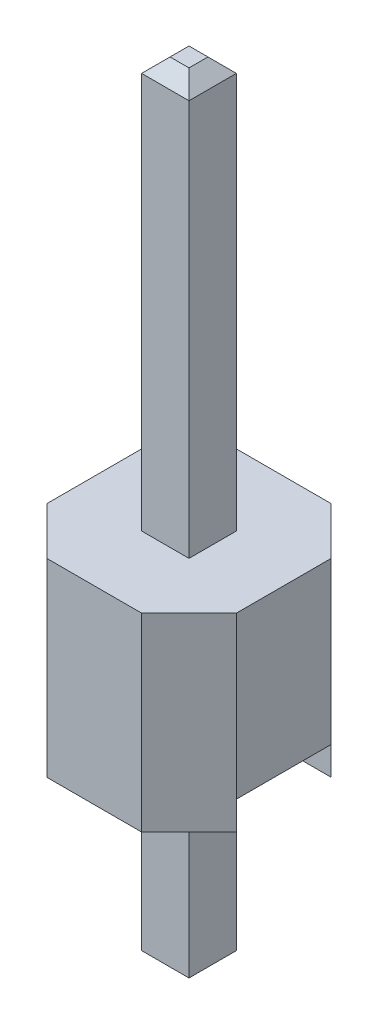
ISO-10303-21;
HEADER;
FILE_DESCRIPTION(('STEP AP214'),'2;1');
FILE_NAME('part.step','',(''),(''),'','','');
FILE_SCHEMA(('AUTOMOTIVE_DESIGN { 1 0 10303 214 1 1 1 1 }'));
ENDSEC;
DATA;
#1=APPLICATION_CONTEXT('core data for automotive mechanical design processes');
#2=APPLICATION_PROTOCOL_DEFINITION('international standard','automotive_design',2000,#1);
#3=PRODUCT_CONTEXT('',#1,'mechanical');
#4=PRODUCT('Part','Part','',(#3));
#5=PRODUCT_RELATED_PRODUCT_CATEGORY('part','',(#4));
#6=PRODUCT_DEFINITION_FORMATION('','',#4);
#7=PRODUCT_DEFINITION_CONTEXT('part definition',#1,'design');
#8=PRODUCT_DEFINITION('design','',#6,#7);
#9=PRODUCT_DEFINITION_SHAPE('','',#8);
#10=(LENGTH_UNIT() NAMED_UNIT(*) SI_UNIT(.MILLI.,.METRE.));
#11=(NAMED_UNIT(*) PLANE_ANGLE_UNIT() SI_UNIT($,.RADIAN.));
#12=(NAMED_UNIT(*) SI_UNIT($,.STERADIAN.) SOLID_ANGLE_UNIT());
#13=UNCERTAINTY_MEASURE_WITH_UNIT(LENGTH_MEASURE(1.E-05),#10,'distance_accuracy_value','');
#14=(GEOMETRIC_REPRESENTATION_CONTEXT(3) GLOBAL_UNCERTAINTY_ASSIGNED_CONTEXT((#13)) GLOBAL_UNIT_ASSIGNED_CONTEXT((#10,
#11,#12)) REPRESENTATION_CONTEXT('',''));
#15=CARTESIAN_POINT('',(0.,0.,0.));
#16=DIRECTION('',(0.,0.,1.));
#17=DIRECTION('',(1.,0.,0.));
#18=AXIS2_PLACEMENT_3D('',#15,#16,#17);
#19=CARTESIAN_POINT('',(-2.59591892663164,0.381,0.634999999999996));
#20=DIRECTION('',(0.,1.,0.));
#21=DIRECTION('',(0.,0.,1.));
#22=AXIS2_PLACEMENT_3D('',#19,#20,#21);
#23=PLANE('',#22);
#24=DIRECTION('',(0.,0.,-1.));
#25=VECTOR('',#24,1.);
#26=CARTESIAN_POINT('',(-1.27,0.381,0.635000000000008));
#27=LINE('',#26,#25);
#28=CARTESIAN_POINT('',(-1.27,0.381,0.634999999999998));
#29=VERTEX_POINT('',#28);
#30=CARTESIAN_POINT('',(-1.26999999999999,0.381,-0.635000000000004));
#31=VERTEX_POINT('',#30);
#32=EDGE_CURVE('E241',#29,#31,#27,.T.);
#33=ORIENTED_EDGE('',*,*,#32,.T.);
#34=DIRECTION('',(1.,0.,0.));
#35=VECTOR('',#34,1.);
#36=CARTESIAN_POINT('',(-2.59591892663164,0.381,-0.635000000000004));
#37=LINE('',#36,#35);
#38=CARTESIAN_POINT('',(1.27,0.381,-0.634999999999998));
#39=VERTEX_POINT('',#38);
#40=EDGE_CURVE('E249',#31,#39,#37,.T.);
#41=ORIENTED_EDGE('',*,*,#40,.T.);
#42=DIRECTION('',(0.,0.,1.));
#43=VECTOR('',#42,1.);
#44=CARTESIAN_POINT('',(1.27,0.381,0.635000000000002));
#45=LINE('',#44,#43);
#46=CARTESIAN_POINT('',(1.27,0.381,0.635000000000002));
#47=VERTEX_POINT('',#46);
#48=EDGE_CURVE('E244',#39,#47,#45,.T.);
#49=ORIENTED_EDGE('',*,*,#48,.T.);
#50=DIRECTION('',(1.,0.,0.));
#51=VECTOR('',#50,1.);
#52=CARTESIAN_POINT('',(-2.59591892663164,0.381,0.634999999999996));
#53=LINE('',#52,#51);
#54=EDGE_CURVE('E254',#29,#47,#53,.T.);
#55=ORIENTED_EDGE('',*,*,#54,.F.);
#56=EDGE_LOOP('',(#33,#41,#49,#55));
#57=FACE_BOUND('',#56,.T.);
#58=DIRECTION('',(0.,0.,1.));
#59=VECTOR('',#58,1.);
#60=CARTESIAN_POINT('',(0.3175,0.381,-0.3175));
#61=LINE('',#60,#59);
#62=CARTESIAN_POINT('',(0.3175,0.381,-0.3175));
#63=VERTEX_POINT('',#62);
#64=CARTESIAN_POINT('',(0.3175,0.381,0.3175));
#65=VERTEX_POINT('',#64);
#66=EDGE_CURVE('E186',#63,#65,#61,.T.);
#67=ORIENTED_EDGE('',*,*,#66,.F.);
#68=DIRECTION('',(1.,0.,0.));
#69=VECTOR('',#68,1.);
#70=CARTESIAN_POINT('',(-0.3175,0.381,-0.3175));
#71=LINE('',#70,#69);
#72=CARTESIAN_POINT('',(-0.3175,0.381,-0.3175));
#73=VERTEX_POINT('',#72);
#74=EDGE_CURVE('E191',#73,#63,#71,.T.);
#75=ORIENTED_EDGE('',*,*,#74,.F.);
#76=DIRECTION('',(0.,0.,-1.));
#77=VECTOR('',#76,1.);
#78=CARTESIAN_POINT('',(-0.3175,0.381,-0.3175));
#79=LINE('',#78,#77);
#80=CARTESIAN_POINT('',(-0.3175,0.381,0.3175));
#81=VERTEX_POINT('',#80);
#82=EDGE_CURVE('E203',#81,#73,#79,.T.);
#83=ORIENTED_EDGE('',*,*,#82,.F.);
#84=DIRECTION('',(-1.,0.,0.));
#85=VECTOR('',#84,1.);
#86=CARTESIAN_POINT('',(-0.3175,0.381,0.3175));
#87=LINE('',#86,#85);
#88=EDGE_CURVE('E199',#65,#81,#87,.T.);
#89=ORIENTED_EDGE('',*,*,#88,.F.);
#90=EDGE_LOOP('',(#67,#75,#83,#89));
#91=FACE_BOUND('',#90,.T.);
#92=ADVANCED_FACE('F36',(#57,#91),#23,.F.);
#93=CARTESIAN_POINT('',(0.,2.54,0.));
#94=DIRECTION('',(0.,1.,0.));
#95=DIRECTION('',(0.,0.,1.));
#96=AXIS2_PLACEMENT_3D('',#93,#94,#95);
#97=PLANE('',#96);
#98=DIRECTION('',(-1.,0.,0.));
#99=VECTOR('',#98,1.);
#100=CARTESIAN_POINT('',(-0.634999999999986,2.54,-1.27000000000001));
#101=LINE('',#100,#99);
#102=CARTESIAN_POINT('',(0.634999999999999,2.54,-1.27));
#103=VERTEX_POINT('',#102);
#104=CARTESIAN_POINT('',(-0.634999999999986,2.54,-1.27000000000001));
#105=VERTEX_POINT('',#104);
#106=EDGE_CURVE('E259',#103,#105,#101,.T.);
#107=ORIENTED_EDGE('',*,*,#106,.T.);
#108=DIRECTION('',(-0.707106781186555,0.,0.70710678118654));
#109=VECTOR('',#108,1.);
#110=CARTESIAN_POINT('',(-1.26999999999999,2.54,-0.635000000000013));
#111=LINE('',#110,#109);
#112=CARTESIAN_POINT('',(-1.26999999999999,2.54,-0.635000000000013));
#113=VERTEX_POINT('',#112);
#114=EDGE_CURVE('E262',#105,#113,#111,.T.);
#115=ORIENTED_EDGE('',*,*,#114,.T.);
#116=DIRECTION('',(0.,0.,1.));
#117=VECTOR('',#116,1.);
#118=CARTESIAN_POINT('',(-1.27,2.54,0.63499999999999));
#119=LINE('',#118,#117);
#120=CARTESIAN_POINT('',(-1.27,2.54,0.63499999999999));
#121=VERTEX_POINT('',#120);
#122=EDGE_CURVE('E265',#113,#121,#119,.T.);
#123=ORIENTED_EDGE('',*,*,#122,.T.);
#124=DIRECTION('',(0.707106781186542,0.,0.707106781186553));
#125=VECTOR('',#124,1.);
#126=CARTESIAN_POINT('',(-0.635000000000008,2.54,1.27));
#127=LINE('',#126,#125);
#128=CARTESIAN_POINT('',(-0.635000000000008,2.54,1.27));
#129=VERTEX_POINT('',#128);
#130=EDGE_CURVE('E267',#121,#129,#127,.T.);
#131=ORIENTED_EDGE('',*,*,#130,.T.);
#132=DIRECTION('',(1.,0.,0.));
#133=VECTOR('',#132,1.);
#134=CARTESIAN_POINT('',(-0.635000000000008,2.54,1.27));
#135=LINE('',#134,#133);
#136=CARTESIAN_POINT('',(0.634999999999995,2.54,1.27));
#137=VERTEX_POINT('',#136);
#138=EDGE_CURVE('E269',#129,#137,#135,.T.);
#139=ORIENTED_EDGE('',*,*,#138,.T.);
#140=DIRECTION('',(0.70710678118655,0.,-0.707106781186545));
#141=VECTOR('',#140,1.);
#142=CARTESIAN_POINT('',(1.27,2.54,0.635000000000004));
#143=LINE('',#142,#141);
#144=CARTESIAN_POINT('',(1.27,2.54,0.635000000000004));
#145=VERTEX_POINT('',#144);
#146=EDGE_CURVE('E271',#137,#145,#143,.T.);
#147=ORIENTED_EDGE('',*,*,#146,.T.);
#148=DIRECTION('',(0.,0.,-1.));
#149=VECTOR('',#148,1.);
#150=CARTESIAN_POINT('',(1.27,2.54,0.635000000000004));
#151=LINE('',#150,#149);
#152=CARTESIAN_POINT('',(1.27,2.54,-0.634999999999999));
#153=VERTEX_POINT('',#152);
#154=EDGE_CURVE('E273',#145,#153,#151,.T.);
#155=ORIENTED_EDGE('',*,*,#154,.T.);
#156=DIRECTION('',(-0.707106781186548,0.,-0.707106781186548));
#157=VECTOR('',#156,1.);
#158=CARTESIAN_POINT('',(0.634999999999999,2.54,-1.27));
#159=LINE('',#158,#157);
#160=EDGE_CURVE('E275',#153,#103,#159,.T.);
#161=ORIENTED_EDGE('',*,*,#160,.T.);
#162=EDGE_LOOP('',(#107,#115,#123,#131,#139,#147,#155,#161));
#163=FACE_BOUND('',#162,.T.);
#164=DIRECTION('',(-1.,0.,0.));
#165=VECTOR('',#164,1.);
#166=CARTESIAN_POINT('',(-0.3175,2.54,-0.3175));
#167=LINE('',#166,#165);
#168=CARTESIAN_POINT('',(0.3175,2.54,-0.3175));
#169=VERTEX_POINT('',#168);
#170=CARTESIAN_POINT('',(-0.3175,2.54,-0.3175));
#171=VERTEX_POINT('',#170);
#172=EDGE_CURVE('E217',#169,#171,#167,.T.);
#173=ORIENTED_EDGE('',*,*,#172,.F.);
#174=DIRECTION('',(0.,0.,-1.));
#175=VECTOR('',#174,1.);
#176=CARTESIAN_POINT('',(0.3175,2.54,0.3175));
#177=LINE('',#176,#175);
#178=CARTESIAN_POINT('',(0.3175,2.54,0.3175));
#179=VERTEX_POINT('',#178);
#180=EDGE_CURVE('E214',#179,#169,#177,.T.);
#181=ORIENTED_EDGE('',*,*,#180,.F.);
#182=DIRECTION('',(1.,0.,0.));
#183=VECTOR('',#182,1.);
#184=CARTESIAN_POINT('',(-0.3175,2.54,0.3175));
#185=LINE('',#184,#183);
#186=CARTESIAN_POINT('',(-0.3175,2.54,0.3175));
#187=VERTEX_POINT('',#186);
#188=EDGE_CURVE('E224',#187,#179,#185,.T.);
#189=ORIENTED_EDGE('',*,*,#188,.F.);
#190=DIRECTION('',(0.,0.,1.));
#191=VECTOR('',#190,1.);
#192=CARTESIAN_POINT('',(-0.3175,2.54,0.3175));
#193=LINE('',#192,#191);
#194=EDGE_CURVE('E221',#171,#187,#193,.T.);
#195=ORIENTED_EDGE('',*,*,#194,.F.);
#196=EDGE_LOOP('',(#173,#181,#189,#195));
#197=FACE_BOUND('',#196,.T.);
#198=ADVANCED_FACE('F389',(#163,#197),#97,.T.);
#199=CARTESIAN_POINT('',(0.,0.,0.));
#200=DIRECTION('',(0.,1.,0.));
#201=DIRECTION('',(0.,0.,1.));
#202=AXIS2_PLACEMENT_3D('',#199,#200,#201);
#203=PLANE('',#202);
#204=DIRECTION('',(-0.707106781186548,0.,-0.707106781186548));
#205=VECTOR('',#204,1.);
#206=CARTESIAN_POINT('',(0.634999999999999,0.,-1.27));
#207=LINE('',#206,#205);
#208=CARTESIAN_POINT('',(1.27,0.,-0.634999999999999));
#209=VERTEX_POINT('',#208);
#210=CARTESIAN_POINT('',(0.634999999999999,0.,-1.27));
#211=VERTEX_POINT('',#210);
#212=EDGE_CURVE('E263',#209,#211,#207,.T.);
#213=ORIENTED_EDGE('',*,*,#212,.F.);
#214=DIRECTION('',(1.,0.,0.));
#215=VECTOR('',#214,1.);
#216=CARTESIAN_POINT('',(-2.59591892663164,0.,-0.635000000000005));
#217=LINE('',#216,#215);
#218=CARTESIAN_POINT('',(-1.26999999999999,0.,-0.635000000000006));
#219=VERTEX_POINT('',#218);
#220=EDGE_CURVE('E239',#219,#209,#217,.T.);
#221=ORIENTED_EDGE('',*,*,#220,.F.);
#222=DIRECTION('',(-0.707106781186555,0.,0.70710678118654));
#223=VECTOR('',#222,1.);
#224=CARTESIAN_POINT('',(-1.26999999999999,0.,-0.635000000000013));
#225=LINE('',#224,#223);
#226=CARTESIAN_POINT('',(-0.634999999999986,0.,-1.27000000000001));
#227=VERTEX_POINT('',#226);
#228=EDGE_CURVE('E280',#227,#219,#225,.T.);
#229=ORIENTED_EDGE('',*,*,#228,.F.);
#230=DIRECTION('',(-1.,0.,0.));
#231=VECTOR('',#230,1.);
#232=CARTESIAN_POINT('',(-0.634999999999986,0.,-1.27000000000001));
#233=LINE('',#232,#231);
#234=EDGE_CURVE('E258',#211,#227,#233,.T.);
#235=ORIENTED_EDGE('',*,*,#234,.F.);
#236=EDGE_LOOP('',(#213,#221,#229,#235));
#237=FACE_BOUND('',#236,.T.);
#238=ADVANCED_FACE('F395',(#237),#203,.F.);
#239=CARTESIAN_POINT('',(-0.634999999999986,2.54,-1.27000000000001));
#240=DIRECTION('',(0.,0.,1.));
#241=DIRECTION('',(1.,0.,0.));
#242=AXIS2_PLACEMENT_3D('',#239,#240,#241);
#243=PLANE('',#242);
#244=ORIENTED_EDGE('',*,*,#234,.T.);
#245=DIRECTION('',(0.,-1.,0.));
#246=VECTOR('',#245,1.);
#247=CARTESIAN_POINT('',(-0.634999999999986,2.54,-1.27000000000001));
#248=LINE('',#247,#246);
#249=EDGE_CURVE('E311',#105,#227,#248,.T.);
#250=ORIENTED_EDGE('',*,*,#249,.F.);
#251=ORIENTED_EDGE('',*,*,#106,.F.);
#252=DIRECTION('',(0.,-1.,0.));
#253=VECTOR('',#252,1.);
#254=CARTESIAN_POINT('',(0.634999999999999,2.54,-1.27));
#255=LINE('',#254,#253);
#256=EDGE_CURVE('E277',#103,#211,#255,.T.);
#257=ORIENTED_EDGE('',*,*,#256,.T.);
#258=EDGE_LOOP('',(#244,#250,#251,#257));
#259=FACE_BOUND('',#258,.T.);
#260=ADVANCED_FACE('F437',(#259),#243,.F.);
#261=CARTESIAN_POINT('',(-1.26999999999999,2.54,-0.635000000000013));
#262=DIRECTION('',(0.70710678118654,0.,0.707106781186555));
#263=DIRECTION('',(0.707106781186555,0.,-0.70710678118654));
#264=AXIS2_PLACEMENT_3D('',#261,#262,#263);
#265=PLANE('',#264);
#266=ORIENTED_EDGE('',*,*,#228,.T.);
#267=DIRECTION('',(0.,-1.,0.));
#268=VECTOR('',#267,1.);
#269=CARTESIAN_POINT('',(-1.26999999999999,0.,-0.635000000000003));
#270=LINE('',#269,#268);
#271=EDGE_CURVE('E238',#31,#219,#270,.T.);
#272=ORIENTED_EDGE('',*,*,#271,.F.);
#273=DIRECTION('',(0.,-1.,0.));
#274=VECTOR('',#273,1.);
#275=CARTESIAN_POINT('',(-1.26999999999999,2.54,-0.635000000000013));
#276=LINE('',#275,#274);
#277=EDGE_CURVE('E308',#113,#31,#276,.T.);
#278=ORIENTED_EDGE('',*,*,#277,.F.);
#279=ORIENTED_EDGE('',*,*,#114,.F.);
#280=ORIENTED_EDGE('',*,*,#249,.T.);
#281=EDGE_LOOP('',(#266,#272,#278,#279,#280));
#282=FACE_BOUND('',#281,.T.);
#283=ADVANCED_FACE('F433',(#282),#265,.F.);
#284=CARTESIAN_POINT('',(-1.27,2.54,0.63499999999999));
#285=DIRECTION('',(1.,0.,0.));
#286=DIRECTION('',(0.,0.,-1.));
#287=AXIS2_PLACEMENT_3D('',#284,#285,#286);
#288=PLANE('',#287);
#289=ORIENTED_EDGE('',*,*,#277,.T.);
#290=ORIENTED_EDGE('',*,*,#32,.F.);
#291=DIRECTION('',(0.,-1.,0.));
#292=VECTOR('',#291,1.);
#293=CARTESIAN_POINT('',(-1.27,2.54,0.63499999999999));
#294=LINE('',#293,#292);
#295=EDGE_CURVE('E305',#121,#29,#294,.T.);
#296=ORIENTED_EDGE('',*,*,#295,.F.);
#297=ORIENTED_EDGE('',*,*,#122,.F.);
#298=EDGE_LOOP('',(#289,#290,#296,#297));
#299=FACE_BOUND('',#298,.T.);
#300=ADVANCED_FACE('F429',(#299),#288,.F.);
#301=CARTESIAN_POINT('',(-0.635000000000008,2.54,1.27));
#302=DIRECTION('',(0.707106781186553,0.,-0.707106781186542));
#303=DIRECTION('',(-0.707106781186542,0.,-0.707106781186553));
#304=AXIS2_PLACEMENT_3D('',#301,#302,#303);
#305=PLANE('',#304);
#306=DIRECTION('',(0.707106781186542,0.,0.707106781186553));
#307=VECTOR('',#306,1.);
#308=CARTESIAN_POINT('',(-0.635000000000008,0.,1.27));
#309=LINE('',#308,#307);
#310=CARTESIAN_POINT('',(-1.27,0.,0.635));
#311=VERTEX_POINT('',#310);
#312=CARTESIAN_POINT('',(-0.635000000000008,0.,1.27));
#313=VERTEX_POINT('',#312);
#314=EDGE_CURVE('E283',#311,#313,#309,.T.);
#315=ORIENTED_EDGE('',*,*,#314,.T.);
#316=DIRECTION('',(0.,-1.,0.));
#317=VECTOR('',#316,1.);
#318=CARTESIAN_POINT('',(-0.635000000000008,2.54,1.27));
#319=LINE('',#318,#317);
#320=EDGE_CURVE('E302',#129,#313,#319,.T.);
#321=ORIENTED_EDGE('',*,*,#320,.F.);
#322=ORIENTED_EDGE('',*,*,#130,.F.);
#323=ORIENTED_EDGE('',*,*,#295,.T.);
#324=DIRECTION('',(0.,1.,0.));
#325=VECTOR('',#324,1.);
#326=CARTESIAN_POINT('',(-1.27,0.,0.635));
#327=LINE('',#326,#325);
#328=EDGE_CURVE('E236',#311,#29,#327,.T.);
#329=ORIENTED_EDGE('',*,*,#328,.F.);
#330=EDGE_LOOP('',(#315,#321,#322,#323,#329));
#331=FACE_BOUND('',#330,.T.);
#332=ADVANCED_FACE('F425',(#331),#305,.F.);
#333=CARTESIAN_POINT('',(-0.635000000000008,2.54,1.27));
#334=DIRECTION('',(0.,0.,-1.));
#335=DIRECTION('',(-1.,0.,0.));
#336=AXIS2_PLACEMENT_3D('',#333,#334,#335);
#337=PLANE('',#336);
#338=DIRECTION('',(1.,0.,0.));
#339=VECTOR('',#338,1.);
#340=CARTESIAN_POINT('',(-0.635000000000008,0.,1.27));
#341=LINE('',#340,#339);
#342=CARTESIAN_POINT('',(0.634999999999995,0.,1.27));
#343=VERTEX_POINT('',#342);
#344=EDGE_CURVE('E285',#313,#343,#341,.T.);
#345=ORIENTED_EDGE('',*,*,#344,.T.);
#346=DIRECTION('',(0.,-1.,0.));
#347=VECTOR('',#346,1.);
#348=CARTESIAN_POINT('',(0.634999999999995,2.54,1.27));
#349=LINE('',#348,#347);
#350=EDGE_CURVE('E299',#137,#343,#349,.T.);
#351=ORIENTED_EDGE('',*,*,#350,.F.);
#352=ORIENTED_EDGE('',*,*,#138,.F.);
#353=ORIENTED_EDGE('',*,*,#320,.T.);
#354=EDGE_LOOP('',(#345,#351,#352,#353));
#355=FACE_BOUND('',#354,.T.);
#356=ADVANCED_FACE('F421',(#355),#337,.F.);
#357=CARTESIAN_POINT('',(1.27,2.54,0.635000000000004));
#358=DIRECTION('',(-0.707106781186545,0.,-0.70710678118655));
#359=DIRECTION('',(-0.70710678118655,0.,0.707106781186545));
#360=AXIS2_PLACEMENT_3D('',#357,#358,#359);
#361=PLANE('',#360);
#362=DIRECTION('',(0.70710678118655,0.,-0.707106781186545));
#363=VECTOR('',#362,1.);
#364=CARTESIAN_POINT('',(1.27,0.,0.635000000000004));
#365=LINE('',#364,#363);
#366=CARTESIAN_POINT('',(1.27,0.,0.635000000000004));
#367=VERTEX_POINT('',#366);
#368=EDGE_CURVE('E287',#343,#367,#365,.T.);
#369=ORIENTED_EDGE('',*,*,#368,.T.);
#370=DIRECTION('',(0.,-1.,0.));
#371=VECTOR('',#370,1.);
#372=CARTESIAN_POINT('',(1.27,0.,0.635000000000004));
#373=LINE('',#372,#371);
#374=EDGE_CURVE('E247',#47,#367,#373,.T.);
#375=ORIENTED_EDGE('',*,*,#374,.F.);
#376=DIRECTION('',(0.,-1.,0.));
#377=VECTOR('',#376,1.);
#378=CARTESIAN_POINT('',(1.27,2.54,0.635000000000004));
#379=LINE('',#378,#377);
#380=EDGE_CURVE('E296',#145,#47,#379,.T.);
#381=ORIENTED_EDGE('',*,*,#380,.F.);
#382=ORIENTED_EDGE('',*,*,#146,.F.);
#383=ORIENTED_EDGE('',*,*,#350,.T.);
#384=EDGE_LOOP('',(#369,#375,#381,#382,#383));
#385=FACE_BOUND('',#384,.T.);
#386=ADVANCED_FACE('F417',(#385),#361,.F.);
#387=CARTESIAN_POINT('',(1.27,2.54,0.635000000000004));
#388=DIRECTION('',(-1.,0.,0.));
#389=DIRECTION('',(0.,0.,1.));
#390=AXIS2_PLACEMENT_3D('',#387,#388,#389);
#391=PLANE('',#390);
#392=ORIENTED_EDGE('',*,*,#380,.T.);
#393=ORIENTED_EDGE('',*,*,#48,.F.);
#394=DIRECTION('',(0.,-1.,0.));
#395=VECTOR('',#394,1.);
#396=CARTESIAN_POINT('',(1.27,2.54,-0.634999999999999));
#397=LINE('',#396,#395);
#398=EDGE_CURVE('E293',#153,#39,#397,.T.);
#399=ORIENTED_EDGE('',*,*,#398,.F.);
#400=ORIENTED_EDGE('',*,*,#154,.F.);
#401=EDGE_LOOP('',(#392,#393,#399,#400));
#402=FACE_BOUND('',#401,.T.);
#403=ADVANCED_FACE('F413',(#402),#391,.F.);
#404=CARTESIAN_POINT('',(0.634999999999999,2.54,-1.27));
#405=DIRECTION('',(-0.707106781186548,0.,0.707106781186548));
#406=DIRECTION('',(0.707106781186548,0.,0.707106781186548));
#407=AXIS2_PLACEMENT_3D('',#404,#405,#406);
#408=PLANE('',#407);
#409=ORIENTED_EDGE('',*,*,#212,.T.);
#410=ORIENTED_EDGE('',*,*,#256,.F.);
#411=ORIENTED_EDGE('',*,*,#160,.F.);
#412=ORIENTED_EDGE('',*,*,#398,.T.);
#413=DIRECTION('',(0.,1.,0.));
#414=VECTOR('',#413,1.);
#415=CARTESIAN_POINT('',(1.27,0.,-0.634999999999999));
#416=LINE('',#415,#414);
#417=EDGE_CURVE('E235',#209,#39,#416,.T.);
#418=ORIENTED_EDGE('',*,*,#417,.F.);
#419=EDGE_LOOP('',(#409,#410,#411,#412,#418));
#420=FACE_BOUND('',#419,.T.);
#421=ADVANCED_FACE('F409',(#420),#408,.F.);
#422=ORIENTED_EDGE('',*,*,#314,.F.);
#423=DIRECTION('',(1.,0.,0.));
#424=VECTOR('',#423,1.);
#425=CARTESIAN_POINT('',(-2.59591892663164,0.,0.634999999999998));
#426=LINE('',#425,#424);
#427=EDGE_CURVE('E251',#311,#367,#426,.T.);
#428=ORIENTED_EDGE('',*,*,#427,.T.);
#429=ORIENTED_EDGE('',*,*,#368,.F.);
#430=ORIENTED_EDGE('',*,*,#344,.F.);
#431=EDGE_LOOP('',(#422,#428,#429,#430));
#432=FACE_BOUND('',#431,.T.);
#433=ADVANCED_FACE('F404',(#432),#203,.F.);
#434=CARTESIAN_POINT('',(-2.59591892663164,0.,-0.635000000000005));
#435=DIRECTION('',(0.,0.,-1.));
#436=DIRECTION('',(0.,1.,0.));
#437=AXIS2_PLACEMENT_3D('',#434,#435,#436);
#438=PLANE('',#437);
#439=ORIENTED_EDGE('',*,*,#271,.T.);
#440=ORIENTED_EDGE('',*,*,#220,.T.);
#441=ORIENTED_EDGE('',*,*,#417,.T.);
#442=ORIENTED_EDGE('',*,*,#40,.F.);
#443=EDGE_LOOP('',(#439,#440,#441,#442));
#444=FACE_BOUND('',#443,.T.);
#445=ADVANCED_FACE('F402',(#444),#438,.F.);
#446=CARTESIAN_POINT('',(-2.59591892663164,0.,0.634999999999998));
#447=DIRECTION('',(0.,0.,1.));
#448=DIRECTION('',(0.,-1.,0.));
#449=AXIS2_PLACEMENT_3D('',#446,#447,#448);
#450=PLANE('',#449);
#451=ORIENTED_EDGE('',*,*,#328,.T.);
#452=ORIENTED_EDGE('',*,*,#54,.T.);
#453=ORIENTED_EDGE('',*,*,#374,.T.);
#454=ORIENTED_EDGE('',*,*,#427,.F.);
#455=EDGE_LOOP('',(#451,#452,#453,#454));
#456=FACE_BOUND('',#455,.T.);
#457=ADVANCED_FACE('F400',(#456),#450,.F.);
#458=CARTESIAN_POINT('',(0.3175,8.04,0.3175));
#459=DIRECTION('',(-1.,0.,0.));
#460=DIRECTION('',(0.,0.,1.));
#461=AXIS2_PLACEMENT_3D('',#458,#459,#460);
#462=PLANE('',#461);
#463=DIRECTION('',(0.,-1.,0.));
#464=VECTOR('',#463,1.);
#465=CARTESIAN_POINT('',(0.3175,8.04,-0.3175));
#466=LINE('',#465,#464);
#467=CARTESIAN_POINT('',(0.3175,7.8495,-0.3175));
#468=VERTEX_POINT('',#467);
#469=EDGE_CURVE('E233',#468,#169,#466,.T.);
#470=ORIENTED_EDGE('',*,*,#469,.F.);
#471=DIRECTION('',(0.,0.,1.));
#472=VECTOR('',#471,1.);
#473=CARTESIAN_POINT('',(0.3175,7.8495,0.3175));
#474=LINE('',#473,#472);
#475=CARTESIAN_POINT('',(0.3175,7.8495,0.3175));
#476=VERTEX_POINT('',#475);
#477=EDGE_CURVE('E326',#468,#476,#474,.T.);
#478=ORIENTED_EDGE('',*,*,#477,.T.);
#479=DIRECTION('',(0.,-1.,0.));
#480=VECTOR('',#479,1.);
#481=CARTESIAN_POINT('',(0.3175,8.04,0.3175));
#482=LINE('',#481,#480);
#483=EDGE_CURVE('E227',#476,#179,#482,.T.);
#484=ORIENTED_EDGE('',*,*,#483,.T.);
#485=ORIENTED_EDGE('',*,*,#180,.T.);
#486=EDGE_LOOP('',(#470,#478,#484,#485));
#487=FACE_BOUND('',#486,.T.);
#488=ADVANCED_FACE('F532',(#487),#462,.F.);
#489=CARTESIAN_POINT('',(-0.3175,8.04,-0.3175));
#490=DIRECTION('',(0.,0.,1.));
#491=DIRECTION('',(1.,0.,0.));
#492=AXIS2_PLACEMENT_3D('',#489,#490,#491);
#493=PLANE('',#492);
#494=DIRECTION('',(0.,-1.,0.));
#495=VECTOR('',#494,1.);
#496=CARTESIAN_POINT('',(-0.3175,8.04,-0.3175));
#497=LINE('',#496,#495);
#498=CARTESIAN_POINT('',(-0.3175,7.8495,-0.3175));
#499=VERTEX_POINT('',#498);
#500=EDGE_CURVE('E231',#499,#171,#497,.T.);
#501=ORIENTED_EDGE('',*,*,#500,.F.);
#502=DIRECTION('',(1.,0.,0.));
#503=VECTOR('',#502,1.);
#504=CARTESIAN_POINT('',(-0.3175,7.8495,-0.3175));
#505=LINE('',#504,#503);
#506=EDGE_CURVE('E323',#499,#468,#505,.T.);
#507=ORIENTED_EDGE('',*,*,#506,.T.);
#508=ORIENTED_EDGE('',*,*,#469,.T.);
#509=ORIENTED_EDGE('',*,*,#172,.T.);
#510=EDGE_LOOP('',(#501,#507,#508,#509));
#511=FACE_BOUND('',#510,.T.);
#512=ADVANCED_FACE('F519',(#511),#493,.F.);
#513=CARTESIAN_POINT('',(-0.3175,8.04,0.3175));
#514=DIRECTION('',(1.,0.,0.));
#515=DIRECTION('',(0.,0.,-1.));
#516=AXIS2_PLACEMENT_3D('',#513,#514,#515);
#517=PLANE('',#516);
#518=DIRECTION('',(0.,-1.,0.));
#519=VECTOR('',#518,1.);
#520=CARTESIAN_POINT('',(-0.3175,8.04,0.3175));
#521=LINE('',#520,#519);
#522=CARTESIAN_POINT('',(-0.3175,7.8495,0.3175));
#523=VERTEX_POINT('',#522);
#524=EDGE_CURVE('E229',#523,#187,#521,.T.);
#525=ORIENTED_EDGE('',*,*,#524,.F.);
#526=DIRECTION('',(0.,0.,-1.));
#527=VECTOR('',#526,1.);
#528=CARTESIAN_POINT('',(-0.3175,7.8495,0.3175));
#529=LINE('',#528,#527);
#530=EDGE_CURVE('E328',#523,#499,#529,.T.);
#531=ORIENTED_EDGE('',*,*,#530,.T.);
#532=ORIENTED_EDGE('',*,*,#500,.T.);
#533=ORIENTED_EDGE('',*,*,#194,.T.);
#534=EDGE_LOOP('',(#525,#531,#532,#533));
#535=FACE_BOUND('',#534,.T.);
#536=ADVANCED_FACE('F512',(#535),#517,.F.);
#537=CARTESIAN_POINT('',(-0.3175,8.04,0.3175));
#538=DIRECTION('',(0.,0.,-1.));
#539=DIRECTION('',(-1.,0.,0.));
#540=AXIS2_PLACEMENT_3D('',#537,#538,#539);
#541=PLANE('',#540);
#542=ORIENTED_EDGE('',*,*,#483,.F.);
#543=DIRECTION('',(-1.,0.,0.));
#544=VECTOR('',#543,1.);
#545=CARTESIAN_POINT('',(-0.3175,7.8495,0.3175));
#546=LINE('',#545,#544);
#547=EDGE_CURVE('E330',#476,#523,#546,.T.);
#548=ORIENTED_EDGE('',*,*,#547,.T.);
#549=ORIENTED_EDGE('',*,*,#524,.T.);
#550=ORIENTED_EDGE('',*,*,#188,.T.);
#551=EDGE_LOOP('',(#542,#548,#549,#550));
#552=FACE_BOUND('',#551,.T.);
#553=ADVANCED_FACE('F518',(#552),#541,.F.);
#554=CARTESIAN_POINT('',(0.,8.04,0.));
#555=DIRECTION('',(0.,-1.,0.));
#556=DIRECTION('',(0.,0.,-1.));
#557=AXIS2_PLACEMENT_3D('',#554,#555,#556);
#558=PLANE('',#557);
#559=DIRECTION('',(0.,0.,-1.));
#560=VECTOR('',#559,1.);
#561=CARTESIAN_POINT('',(0.127000000000001,8.04,0.));
#562=LINE('',#561,#560);
#563=CARTESIAN_POINT('',(0.127000000000001,8.04,0.127000000000001));
#564=VERTEX_POINT('',#563);
#565=CARTESIAN_POINT('',(0.127000000000001,8.04,-0.127000000000001));
#566=VERTEX_POINT('',#565);
#567=EDGE_CURVE('E318',#564,#566,#562,.T.);
#568=ORIENTED_EDGE('',*,*,#567,.T.);
#569=DIRECTION('',(-1.,0.,0.));
#570=VECTOR('',#569,1.);
#571=CARTESIAN_POINT('',(0.,8.04,-0.127000000000001));
#572=LINE('',#571,#570);
#573=CARTESIAN_POINT('',(-0.127000000000001,8.04,-0.127000000000001));
#574=VERTEX_POINT('',#573);
#575=EDGE_CURVE('E320',#566,#574,#572,.T.);
#576=ORIENTED_EDGE('',*,*,#575,.T.);
#577=DIRECTION('',(0.,0.,1.));
#578=VECTOR('',#577,1.);
#579=CARTESIAN_POINT('',(-0.127000000000001,8.04,0.));
#580=LINE('',#579,#578);
#581=CARTESIAN_POINT('',(-0.127000000000001,8.04,0.127000000000001));
#582=VERTEX_POINT('',#581);
#583=EDGE_CURVE('E316',#574,#582,#580,.T.);
#584=ORIENTED_EDGE('',*,*,#583,.T.);
#585=DIRECTION('',(1.,0.,0.));
#586=VECTOR('',#585,1.);
#587=CARTESIAN_POINT('',(0.,8.04,0.127000000000001));
#588=LINE('',#587,#586);
#589=EDGE_CURVE('E314',#582,#564,#588,.T.);
#590=ORIENTED_EDGE('',*,*,#589,.T.);
#591=EDGE_LOOP('',(#568,#576,#584,#590));
#592=FACE_BOUND('',#591,.T.);
#593=ADVANCED_FACE('F457',(#592),#558,.F.);
#594=CARTESIAN_POINT('',(0.,8.04,0.127000000000001));
#595=DIRECTION('',(0.,-0.707106781186543,-0.707106781186552));
#596=DIRECTION('',(1.,0.,0.));
#597=AXIS2_PLACEMENT_3D('',#594,#595,#596);
#598=PLANE('',#597);
#599=DIRECTION('',(-0.577350269189623,-0.577350269189631,0.577350269189623));
#600=VECTOR('',#599,1.);
#601=CARTESIAN_POINT('',(-0.0846666666666678,8.08233333333333,0.0846666666666678));
#602=LINE('',#601,#600);
#603=EDGE_CURVE('E336',#523,#582,#602,.F.);
#604=ORIENTED_EDGE('',*,*,#603,.F.);
#605=ORIENTED_EDGE('',*,*,#547,.F.);
#606=DIRECTION('',(-0.577350269189623,0.577350269189631,-0.577350269189623));
#607=VECTOR('',#606,1.);
#608=CARTESIAN_POINT('',(0.0846666666666678,8.08233333333333,0.0846666666666678));
#609=LINE('',#608,#607);
#610=EDGE_CURVE('E218',#564,#476,#609,.F.);
#611=ORIENTED_EDGE('',*,*,#610,.F.);
#612=ORIENTED_EDGE('',*,*,#589,.F.);
#613=EDGE_LOOP('',(#604,#605,#611,#612));
#614=FACE_BOUND('',#613,.T.);
#615=ADVANCED_FACE('F453',(#614),#598,.F.);
#616=CARTESIAN_POINT('',(0.127000000000001,8.04,0.));
#617=DIRECTION('',(-0.707106781186552,-0.707106781186543,0.));
#618=DIRECTION('',(0.,0.,-1.));
#619=AXIS2_PLACEMENT_3D('',#616,#617,#618);
#620=PLANE('',#619);
#621=ORIENTED_EDGE('',*,*,#610,.T.);
#622=ORIENTED_EDGE('',*,*,#477,.F.);
#623=DIRECTION('',(-0.577350269189623,0.577350269189631,0.577350269189623));
#624=VECTOR('',#623,1.);
#625=CARTESIAN_POINT('',(0.0846666666666679,8.08233333333333,-0.0846666666666678));
#626=LINE('',#625,#624);
#627=EDGE_CURVE('E334',#566,#468,#626,.F.);
#628=ORIENTED_EDGE('',*,*,#627,.F.);
#629=ORIENTED_EDGE('',*,*,#567,.F.);
#630=EDGE_LOOP('',(#621,#622,#628,#629));
#631=FACE_BOUND('',#630,.T.);
#632=ADVANCED_FACE('F449',(#631),#620,.F.);
#633=CARTESIAN_POINT('',(-0.127000000000001,8.04,0.));
#634=DIRECTION('',(0.707106781186552,-0.707106781186543,0.));
#635=DIRECTION('',(0.,0.,1.));
#636=AXIS2_PLACEMENT_3D('',#633,#634,#635);
#637=PLANE('',#636);
#638=ORIENTED_EDGE('',*,*,#603,.T.);
#639=ORIENTED_EDGE('',*,*,#583,.F.);
#640=DIRECTION('',(-0.577350269189623,-0.577350269189631,-0.577350269189623));
#641=VECTOR('',#640,1.);
#642=CARTESIAN_POINT('',(-0.0846666666666679,8.08233333333333,-0.0846666666666678));
#643=LINE('',#642,#641);
#644=EDGE_CURVE('E213',#499,#574,#643,.F.);
#645=ORIENTED_EDGE('',*,*,#644,.F.);
#646=ORIENTED_EDGE('',*,*,#530,.F.);
#647=EDGE_LOOP('',(#638,#639,#645,#646));
#648=FACE_BOUND('',#647,.T.);
#649=ADVANCED_FACE('F445',(#648),#637,.F.);
#650=CARTESIAN_POINT('',(0.,8.04,-0.127000000000001));
#651=DIRECTION('',(0.,-0.707106781186543,0.707106781186552));
#652=DIRECTION('',(-1.,0.,0.));
#653=AXIS2_PLACEMENT_3D('',#650,#651,#652);
#654=PLANE('',#653);
#655=ORIENTED_EDGE('',*,*,#627,.T.);
#656=ORIENTED_EDGE('',*,*,#506,.F.);
#657=ORIENTED_EDGE('',*,*,#644,.T.);
#658=ORIENTED_EDGE('',*,*,#575,.F.);
#659=EDGE_LOOP('',(#655,#656,#657,#658));
#660=FACE_BOUND('',#659,.T.);
#661=ADVANCED_FACE('F442',(#660),#654,.F.);
#662=CARTESIAN_POINT('',(0.3175,-2.519,-0.3175));
#663=DIRECTION('',(-1.,0.,0.));
#664=DIRECTION('',(0.,0.,1.));
#665=AXIS2_PLACEMENT_3D('',#662,#663,#664);
#666=PLANE('',#665);
#667=DIRECTION('',(0.,1.,0.));
#668=VECTOR('',#667,1.);
#669=CARTESIAN_POINT('',(0.3175,-2.519,0.3175));
#670=LINE('',#669,#668);
#671=CARTESIAN_POINT('',(0.3175,-2.3285,0.3175));
#672=VERTEX_POINT('',#671);
#673=EDGE_CURVE('E211',#672,#65,#670,.T.);
#674=ORIENTED_EDGE('',*,*,#673,.F.);
#675=DIRECTION('',(0.,0.,-1.));
#676=VECTOR('',#675,1.);
#677=CARTESIAN_POINT('',(0.3175,-2.3285,-0.3175));
#678=LINE('',#677,#676);
#679=CARTESIAN_POINT('',(0.3175,-2.3285,-0.3175));
#680=VERTEX_POINT('',#679);
#681=EDGE_CURVE('E45',#672,#680,#678,.T.);
#682=ORIENTED_EDGE('',*,*,#681,.T.);
#683=DIRECTION('',(0.,1.,0.));
#684=VECTOR('',#683,1.);
#685=CARTESIAN_POINT('',(0.3175,-2.519,-0.3175));
#686=LINE('',#685,#684);
#687=EDGE_CURVE('E183',#680,#63,#686,.T.);
#688=ORIENTED_EDGE('',*,*,#687,.T.);
#689=ORIENTED_EDGE('',*,*,#66,.T.);
#690=EDGE_LOOP('',(#674,#682,#688,#689));
#691=FACE_BOUND('',#690,.T.);
#692=ADVANCED_FACE('F185',(#691),#666,.F.);
#693=CARTESIAN_POINT('',(-0.3175,-2.519,0.3175));
#694=DIRECTION('',(0.,0.,-1.));
#695=DIRECTION('',(-1.,0.,0.));
#696=AXIS2_PLACEMENT_3D('',#693,#694,#695);
#697=PLANE('',#696);
#698=DIRECTION('',(0.,1.,0.));
#699=VECTOR('',#698,1.);
#700=CARTESIAN_POINT('',(-0.3175,-2.519,0.3175));
#701=LINE('',#700,#699);
#702=CARTESIAN_POINT('',(-0.3175,-2.3285,0.3175));
#703=VERTEX_POINT('',#702);
#704=EDGE_CURVE('E209',#703,#81,#701,.T.);
#705=ORIENTED_EDGE('',*,*,#704,.F.);
#706=DIRECTION('',(1.,0.,0.));
#707=VECTOR('',#706,1.);
#708=CARTESIAN_POINT('',(-0.3175,-2.3285,0.3175));
#709=LINE('',#708,#707);
#710=EDGE_CURVE('E11',#703,#672,#709,.T.);
#711=ORIENTED_EDGE('',*,*,#710,.T.);
#712=ORIENTED_EDGE('',*,*,#673,.T.);
#713=ORIENTED_EDGE('',*,*,#88,.T.);
#714=EDGE_LOOP('',(#705,#711,#712,#713));
#715=FACE_BOUND('',#714,.T.);
#716=ADVANCED_FACE('F725',(#715),#697,.F.);
#717=CARTESIAN_POINT('',(-0.3175,-2.519,-0.3175));
#718=DIRECTION('',(1.,0.,0.));
#719=DIRECTION('',(0.,0.,-1.));
#720=AXIS2_PLACEMENT_3D('',#717,#718,#719);
#721=PLANE('',#720);
#722=DIRECTION('',(0.,1.,0.));
#723=VECTOR('',#722,1.);
#724=CARTESIAN_POINT('',(-0.3175,-2.519,-0.3175));
#725=LINE('',#724,#723);
#726=CARTESIAN_POINT('',(-0.3175,-2.3285,-0.3175));
#727=VERTEX_POINT('',#726);
#728=EDGE_CURVE('E190',#727,#73,#725,.T.);
#729=ORIENTED_EDGE('',*,*,#728,.F.);
#730=DIRECTION('',(0.,0.,1.));
#731=VECTOR('',#730,1.);
#732=CARTESIAN_POINT('',(-0.3175,-2.3285,-0.3175));
#733=LINE('',#732,#731);
#734=EDGE_CURVE('E349',#727,#703,#733,.T.);
#735=ORIENTED_EDGE('',*,*,#734,.T.);
#736=ORIENTED_EDGE('',*,*,#704,.T.);
#737=ORIENTED_EDGE('',*,*,#82,.T.);
#738=EDGE_LOOP('',(#729,#735,#736,#737));
#739=FACE_BOUND('',#738,.T.);
#740=ADVANCED_FACE('F375',(#739),#721,.F.);
#741=CARTESIAN_POINT('',(-0.3175,-2.519,-0.3175));
#742=DIRECTION('',(0.,0.,1.));
#743=DIRECTION('',(1.,0.,0.));
#744=AXIS2_PLACEMENT_3D('',#741,#742,#743);
#745=PLANE('',#744);
#746=ORIENTED_EDGE('',*,*,#687,.F.);
#747=DIRECTION('',(-1.,0.,0.));
#748=VECTOR('',#747,1.);
#749=CARTESIAN_POINT('',(-0.3175,-2.3285,-0.3175));
#750=LINE('',#749,#748);
#751=EDGE_CURVE('E352',#680,#727,#750,.T.);
#752=ORIENTED_EDGE('',*,*,#751,.T.);
#753=ORIENTED_EDGE('',*,*,#728,.T.);
#754=ORIENTED_EDGE('',*,*,#74,.T.);
#755=EDGE_LOOP('',(#746,#752,#753,#754));
#756=FACE_BOUND('',#755,.T.);
#757=ADVANCED_FACE('F201',(#756),#745,.F.);
#758=CARTESIAN_POINT('',(0.,-2.519,0.));
#759=DIRECTION('',(0.,1.,0.));
#760=DIRECTION('',(0.,0.,1.));
#761=AXIS2_PLACEMENT_3D('',#758,#759,#760);
#762=PLANE('',#761);
#763=DIRECTION('',(-1.,0.,0.));
#764=VECTOR('',#763,1.);
#765=CARTESIAN_POINT('',(0.,-2.519,0.127000000000002));
#766=LINE('',#765,#764);
#767=CARTESIAN_POINT('',(0.127000000000002,-2.519,0.127000000000002));
#768=VERTEX_POINT('',#767);
#769=CARTESIAN_POINT('',(-0.127000000000002,-2.519,0.127000000000002));
#770=VERTEX_POINT('',#769);
#771=EDGE_CURVE('E332',#768,#770,#766,.T.);
#772=ORIENTED_EDGE('',*,*,#771,.T.);
#773=DIRECTION('',(0.,0.,-1.));
#774=VECTOR('',#773,1.);
#775=CARTESIAN_POINT('',(-0.127000000000002,-2.519,0.));
#776=LINE('',#775,#774);
#777=CARTESIAN_POINT('',(-0.127000000000002,-2.519,-0.127000000000002));
#778=VERTEX_POINT('',#777);
#779=EDGE_CURVE('E346',#770,#778,#776,.T.);
#780=ORIENTED_EDGE('',*,*,#779,.T.);
#781=DIRECTION('',(1.,0.,0.));
#782=VECTOR('',#781,1.);
#783=CARTESIAN_POINT('',(0.,-2.519,-0.127000000000002));
#784=LINE('',#783,#782);
#785=CARTESIAN_POINT('',(0.127000000000002,-2.519,-0.127000000000002));
#786=VERTEX_POINT('',#785);
#787=EDGE_CURVE('E344',#778,#786,#784,.T.);
#788=ORIENTED_EDGE('',*,*,#787,.T.);
#789=DIRECTION('',(0.,0.,1.));
#790=VECTOR('',#789,1.);
#791=CARTESIAN_POINT('',(0.127000000000002,-2.519,0.));
#792=LINE('',#791,#790);
#793=EDGE_CURVE('E342',#786,#768,#792,.T.);
#794=ORIENTED_EDGE('',*,*,#793,.T.);
#795=EDGE_LOOP('',(#772,#780,#788,#794));
#796=FACE_BOUND('',#795,.T.);
#797=ADVANCED_FACE('F380',(#796),#762,.F.);
#798=CARTESIAN_POINT('',(0.127000000000002,-2.519,0.));
#799=DIRECTION('',(-0.707106781186547,0.707106781186547,0.));
#800=DIRECTION('',(0.,0.,1.));
#801=AXIS2_PLACEMENT_3D('',#798,#799,#800);
#802=PLANE('',#801);
#803=DIRECTION('',(0.577350269189626,0.577350269189626,-0.577350269189626));
#804=VECTOR('',#803,1.);
#805=CARTESIAN_POINT('',(0.0846666666666681,-2.56133333333333,-0.084666666666668));
#806=LINE('',#805,#804);
#807=EDGE_CURVE('E358',#680,#786,#806,.F.);
#808=ORIENTED_EDGE('',*,*,#807,.F.);
#809=ORIENTED_EDGE('',*,*,#681,.F.);
#810=DIRECTION('',(0.577350269189626,0.577350269189626,0.577350269189626));
#811=VECTOR('',#810,1.);
#812=CARTESIAN_POINT('',(0.084666666666668,-2.56133333333333,0.0846666666666681));
#813=LINE('',#812,#811);
#814=EDGE_CURVE('E40',#768,#672,#813,.T.);
#815=ORIENTED_EDGE('',*,*,#814,.F.);
#816=ORIENTED_EDGE('',*,*,#793,.F.);
#817=EDGE_LOOP('',(#808,#809,#815,#816));
#818=FACE_BOUND('',#817,.T.);
#819=ADVANCED_FACE('F38',(#818),#802,.F.);
#820=CARTESIAN_POINT('',(0.,-2.519,0.127000000000002));
#821=DIRECTION('',(0.,0.707106781186547,-0.707106781186547));
#822=DIRECTION('',(-1.,0.,0.));
#823=AXIS2_PLACEMENT_3D('',#820,#821,#822);
#824=PLANE('',#823);
#825=ORIENTED_EDGE('',*,*,#814,.T.);
#826=ORIENTED_EDGE('',*,*,#710,.F.);
#827=DIRECTION('',(0.577350269189626,-0.577350269189626,-0.577350269189626));
#828=VECTOR('',#827,1.);
#829=CARTESIAN_POINT('',(-0.084666666666668,-2.56133333333333,0.0846666666666681));
#830=LINE('',#829,#828);
#831=EDGE_CURVE('E357',#770,#703,#830,.F.);
#832=ORIENTED_EDGE('',*,*,#831,.F.);
#833=ORIENTED_EDGE('',*,*,#771,.F.);
#834=EDGE_LOOP('',(#825,#826,#832,#833));
#835=FACE_BOUND('',#834,.T.);
#836=ADVANCED_FACE('F367',(#835),#824,.F.);
#837=CARTESIAN_POINT('',(0.,-2.519,-0.127000000000002));
#838=DIRECTION('',(0.,0.707106781186547,0.707106781186547));
#839=DIRECTION('',(1.,0.,0.));
#840=AXIS2_PLACEMENT_3D('',#837,#838,#839);
#841=PLANE('',#840);
#842=ORIENTED_EDGE('',*,*,#807,.T.);
#843=ORIENTED_EDGE('',*,*,#787,.F.);
#844=DIRECTION('',(-0.577350269189626,0.577350269189626,-0.577350269189626));
#845=VECTOR('',#844,1.);
#846=CARTESIAN_POINT('',(-0.084666666666668,-2.56133333333333,-0.084666666666668));
#847=LINE('',#846,#845);
#848=EDGE_CURVE('E355',#727,#778,#847,.F.);
#849=ORIENTED_EDGE('',*,*,#848,.F.);
#850=ORIENTED_EDGE('',*,*,#751,.F.);
#851=EDGE_LOOP('',(#842,#843,#849,#850));
#852=FACE_BOUND('',#851,.T.);
#853=ADVANCED_FACE('F372',(#852),#841,.F.);
#854=CARTESIAN_POINT('',(-0.127000000000002,-2.519,0.));
#855=DIRECTION('',(0.707106781186547,0.707106781186547,0.));
#856=DIRECTION('',(0.,0.,-1.));
#857=AXIS2_PLACEMENT_3D('',#854,#855,#856);
#858=PLANE('',#857);
#859=ORIENTED_EDGE('',*,*,#831,.T.);
#860=ORIENTED_EDGE('',*,*,#734,.F.);
#861=ORIENTED_EDGE('',*,*,#848,.T.);
#862=ORIENTED_EDGE('',*,*,#779,.F.);
#863=EDGE_LOOP('',(#859,#860,#861,#862));
#864=FACE_BOUND('',#863,.T.);
#865=ADVANCED_FACE('F377',(#864),#858,.F.);
#866=CLOSED_SHELL('',(#92,#198,#238,#260,#283,#300,#332,#356,#386,#403,#421,#433,#445,#457,#488,
#512,#536,#553,#593,#615,#632,#649,#661,#692,#716,#740,#757,#797,#819,#836,#853,#865));
#867=MANIFOLD_SOLID_BREP('B2',#866);
#868=ADVANCED_BREP_SHAPE_REPRESENTATION('',(#18,#867),#14);
#869=SHAPE_DEFINITION_REPRESENTATION(#9,#868);
ENDSEC;
END-ISO-10303-21;
